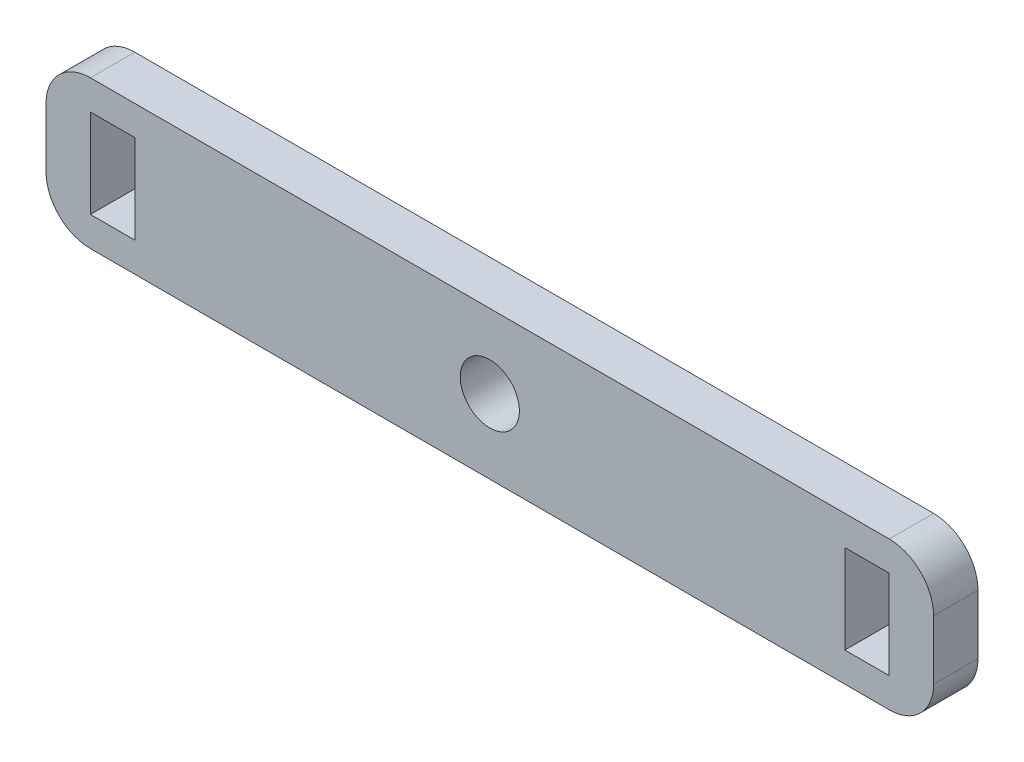
ISO-10303-21;
HEADER;
FILE_DESCRIPTION(('STEP AP214'),'2;1');
FILE_NAME('part.step','',(''),(''),'','','');
FILE_SCHEMA(('AUTOMOTIVE_DESIGN { 1 0 10303 214 1 1 1 1 }'));
ENDSEC;
DATA;
#1=APPLICATION_CONTEXT('core data for automotive mechanical design processes');
#2=APPLICATION_PROTOCOL_DEFINITION('international standard','automotive_design',2000,#1);
#3=PRODUCT_CONTEXT('',#1,'mechanical');
#4=PRODUCT('Part','Part','',(#3));
#5=PRODUCT_RELATED_PRODUCT_CATEGORY('part','',(#4));
#6=PRODUCT_DEFINITION_FORMATION('','',#4);
#7=PRODUCT_DEFINITION_CONTEXT('part definition',#1,'design');
#8=PRODUCT_DEFINITION('design','',#6,#7);
#9=PRODUCT_DEFINITION_SHAPE('','',#8);
#10=(LENGTH_UNIT() NAMED_UNIT(*) SI_UNIT(.MILLI.,.METRE.));
#11=(NAMED_UNIT(*) PLANE_ANGLE_UNIT() SI_UNIT($,.RADIAN.));
#12=(NAMED_UNIT(*) SI_UNIT($,.STERADIAN.) SOLID_ANGLE_UNIT());
#13=UNCERTAINTY_MEASURE_WITH_UNIT(LENGTH_MEASURE(1.E-05),#10,'distance_accuracy_value','');
#14=(GEOMETRIC_REPRESENTATION_CONTEXT(3) GLOBAL_UNCERTAINTY_ASSIGNED_CONTEXT((#13)) GLOBAL_UNIT_ASSIGNED_CONTEXT((#10,
#11,#12)) REPRESENTATION_CONTEXT('',''));
#15=CARTESIAN_POINT('',(0.,0.,0.));
#16=DIRECTION('',(0.,0.,1.));
#17=DIRECTION('',(1.,0.,0.));
#18=AXIS2_PLACEMENT_3D('',#15,#16,#17);
#19=CARTESIAN_POINT('',(0.,0.,3.));
#20=DIRECTION('',(0.,0.,1.));
#21=DIRECTION('',(1.,0.,0.));
#22=AXIS2_PLACEMENT_3D('',#19,#20,#21);
#23=PLANE('',#22);
#24=DIRECTION('',(0.,-1.,0.));
#25=VECTOR('',#24,1.);
#26=CARTESIAN_POINT('',(-27.,3.,3.));
#27=LINE('',#26,#25);
#28=CARTESIAN_POINT('',(-27.,3.,3.));
#29=VERTEX_POINT('',#28);
#30=CARTESIAN_POINT('',(-27.,-3.,3.));
#31=VERTEX_POINT('',#30);
#32=EDGE_CURVE('E208',#29,#31,#27,.T.);
#33=ORIENTED_EDGE('',*,*,#32,.F.);
#34=DIRECTION('',(-1.,0.,0.));
#35=VECTOR('',#34,1.);
#36=CARTESIAN_POINT('',(-27.,3.,3.));
#37=LINE('',#36,#35);
#38=CARTESIAN_POINT('',(-24.,3.,3.));
#39=VERTEX_POINT('',#38);
#40=EDGE_CURVE('E219',#39,#29,#37,.T.);
#41=ORIENTED_EDGE('',*,*,#40,.F.);
#42=DIRECTION('',(0.,1.,0.));
#43=VECTOR('',#42,1.);
#44=CARTESIAN_POINT('',(-24.,3.,3.));
#45=LINE('',#44,#43);
#46=CARTESIAN_POINT('',(-24.,-3.,3.));
#47=VERTEX_POINT('',#46);
#48=EDGE_CURVE('E238',#47,#39,#45,.T.);
#49=ORIENTED_EDGE('',*,*,#48,.F.);
#50=DIRECTION('',(1.,0.,0.));
#51=VECTOR('',#50,1.);
#52=CARTESIAN_POINT('',(-27.,-3.,3.));
#53=LINE('',#52,#51);
#54=EDGE_CURVE('E234',#31,#47,#53,.T.);
#55=ORIENTED_EDGE('',*,*,#54,.F.);
#56=EDGE_LOOP('',(#33,#41,#49,#55));
#57=FACE_BOUND('',#56,.T.);
#58=CARTESIAN_POINT('',(0.,0.,3.));
#59=DIRECTION('',(0.,0.,1.));
#60=DIRECTION('',(1.,0.,0.));
#61=AXIS2_PLACEMENT_3D('',#58,#59,#60);
#62=CIRCLE('',#61,2.);
#63=CARTESIAN_POINT('',(2.,0.,3.));
#64=VERTEX_POINT('',#63);
#65=EDGE_CURVE('E248',#64,#64,#62,.T.);
#66=ORIENTED_EDGE('',*,*,#65,.F.);
#67=EDGE_LOOP('',(#66));
#68=FACE_BOUND('',#67,.T.);
#69=DIRECTION('',(0.,-1.,0.));
#70=VECTOR('',#69,1.);
#71=CARTESIAN_POINT('',(-30.,5.,3.));
#72=LINE('',#71,#70);
#73=CARTESIAN_POINT('',(-30.,2.,3.));
#74=VERTEX_POINT('',#73);
#75=CARTESIAN_POINT('',(-30.,-2.,3.));
#76=VERTEX_POINT('',#75);
#77=EDGE_CURVE('E273',#74,#76,#72,.T.);
#78=ORIENTED_EDGE('',*,*,#77,.T.);
#79=CARTESIAN_POINT('',(-27.,-2.,3.));
#80=DIRECTION('',(0.,0.,1.));
#81=DIRECTION('',(1.,0.,0.));
#82=AXIS2_PLACEMENT_3D('',#79,#80,#81);
#83=CIRCLE('',#82,3.);
#84=CARTESIAN_POINT('',(-27.,-5.,3.));
#85=VERTEX_POINT('',#84);
#86=EDGE_CURVE('E328',#76,#85,#83,.T.);
#87=ORIENTED_EDGE('',*,*,#86,.T.);
#88=DIRECTION('',(1.,0.,0.));
#89=VECTOR('',#88,1.);
#90=CARTESIAN_POINT('',(-30.,-5.,3.));
#91=LINE('',#90,#89);
#92=CARTESIAN_POINT('',(27.,-5.,3.));
#93=VERTEX_POINT('',#92);
#94=EDGE_CURVE('E277',#85,#93,#91,.T.);
#95=ORIENTED_EDGE('',*,*,#94,.T.);
#96=CARTESIAN_POINT('',(27.,-2.,3.));
#97=DIRECTION('',(0.,0.,1.));
#98=DIRECTION('',(1.,0.,0.));
#99=AXIS2_PLACEMENT_3D('',#96,#97,#98);
#100=CIRCLE('',#99,3.);
#101=CARTESIAN_POINT('',(30.,-2.,3.));
#102=VERTEX_POINT('',#101);
#103=EDGE_CURVE('E322',#93,#102,#100,.T.);
#104=ORIENTED_EDGE('',*,*,#103,.T.);
#105=DIRECTION('',(0.,1.,0.));
#106=VECTOR('',#105,1.);
#107=CARTESIAN_POINT('',(30.,5.,3.));
#108=LINE('',#107,#106);
#109=CARTESIAN_POINT('',(30.,2.,3.));
#110=VERTEX_POINT('',#109);
#111=EDGE_CURVE('E266',#102,#110,#108,.T.);
#112=ORIENTED_EDGE('',*,*,#111,.T.);
#113=CARTESIAN_POINT('',(27.,2.,3.));
#114=DIRECTION('',(0.,0.,1.));
#115=DIRECTION('',(1.,0.,0.));
#116=AXIS2_PLACEMENT_3D('',#113,#114,#115);
#117=CIRCLE('',#116,3.);
#118=CARTESIAN_POINT('',(27.,5.,3.));
#119=VERTEX_POINT('',#118);
#120=EDGE_CURVE('E66',#110,#119,#117,.T.);
#121=ORIENTED_EDGE('',*,*,#120,.T.);
#122=DIRECTION('',(-1.,0.,0.));
#123=VECTOR('',#122,1.);
#124=CARTESIAN_POINT('',(-30.,5.,3.));
#125=LINE('',#124,#123);
#126=CARTESIAN_POINT('',(-27.,5.,3.));
#127=VERTEX_POINT('',#126);
#128=EDGE_CURVE('E269',#119,#127,#125,.T.);
#129=ORIENTED_EDGE('',*,*,#128,.T.);
#130=CARTESIAN_POINT('',(-27.,2.,3.));
#131=DIRECTION('',(0.,0.,1.));
#132=DIRECTION('',(1.,0.,0.));
#133=AXIS2_PLACEMENT_3D('',#130,#131,#132);
#134=CIRCLE('',#133,3.);
#135=EDGE_CURVE('E325',#127,#74,#134,.T.);
#136=ORIENTED_EDGE('',*,*,#135,.T.);
#137=EDGE_LOOP('',(#78,#87,#95,#104,#112,#121,#129,#136));
#138=FACE_BOUND('',#137,.T.);
#139=DIRECTION('',(1.,0.,0.));
#140=VECTOR('',#139,1.);
#141=CARTESIAN_POINT('',(27.,3.,3.));
#142=LINE('',#141,#140);
#143=CARTESIAN_POINT('',(24.,3.,3.));
#144=VERTEX_POINT('',#143);
#145=CARTESIAN_POINT('',(27.,3.,3.));
#146=VERTEX_POINT('',#145);
#147=EDGE_CURVE('E199',#144,#146,#142,.T.);
#148=ORIENTED_EDGE('',*,*,#147,.T.);
#149=DIRECTION('',(0.,-1.,0.));
#150=VECTOR('',#149,1.);
#151=CARTESIAN_POINT('',(27.,3.,3.));
#152=LINE('',#151,#150);
#153=CARTESIAN_POINT('',(27.,-3.,3.));
#154=VERTEX_POINT('',#153);
#155=EDGE_CURVE('E179',#146,#154,#152,.T.);
#156=ORIENTED_EDGE('',*,*,#155,.T.);
#157=DIRECTION('',(-1.,0.,0.));
#158=VECTOR('',#157,1.);
#159=CARTESIAN_POINT('',(27.,-3.,3.));
#160=LINE('',#159,#158);
#161=CARTESIAN_POINT('',(24.,-3.,3.));
#162=VERTEX_POINT('',#161);
#163=EDGE_CURVE('E186',#154,#162,#160,.T.);
#164=ORIENTED_EDGE('',*,*,#163,.T.);
#165=DIRECTION('',(0.,1.,0.));
#166=VECTOR('',#165,1.);
#167=CARTESIAN_POINT('',(24.,3.,3.));
#168=LINE('',#167,#166);
#169=EDGE_CURVE('E190',#162,#144,#168,.T.);
#170=ORIENTED_EDGE('',*,*,#169,.T.);
#171=EDGE_LOOP('',(#148,#156,#164,#170));
#172=FACE_BOUND('',#171,.T.);
#173=ADVANCED_FACE('F43',(#57,#68,#138,#172),#23,.T.);
#174=CARTESIAN_POINT('',(0.,0.,0.));
#175=DIRECTION('',(0.,0.,1.));
#176=DIRECTION('',(1.,0.,0.));
#177=AXIS2_PLACEMENT_3D('',#174,#175,#176);
#178=PLANE('',#177);
#179=DIRECTION('',(1.,0.,0.));
#180=VECTOR('',#179,1.);
#181=CARTESIAN_POINT('',(-30.,-5.,0.));
#182=LINE('',#181,#180);
#183=CARTESIAN_POINT('',(-27.,-5.,0.));
#184=VERTEX_POINT('',#183);
#185=CARTESIAN_POINT('',(27.,-5.,0.));
#186=VERTEX_POINT('',#185);
#187=EDGE_CURVE('E270',#184,#186,#182,.T.);
#188=ORIENTED_EDGE('',*,*,#187,.F.);
#189=CARTESIAN_POINT('',(-27.,-2.,0.));
#190=DIRECTION('',(0.,0.,1.));
#191=DIRECTION('',(1.,0.,0.));
#192=AXIS2_PLACEMENT_3D('',#189,#190,#191);
#193=CIRCLE('',#192,3.);
#194=CARTESIAN_POINT('',(-30.,-2.,0.));
#195=VERTEX_POINT('',#194);
#196=EDGE_CURVE('E310',#184,#195,#193,.F.);
#197=ORIENTED_EDGE('',*,*,#196,.T.);
#198=DIRECTION('',(0.,-1.,0.));
#199=VECTOR('',#198,1.);
#200=CARTESIAN_POINT('',(-30.,5.,0.));
#201=LINE('',#200,#199);
#202=CARTESIAN_POINT('',(-30.,2.,0.));
#203=VERTEX_POINT('',#202);
#204=EDGE_CURVE('E288',#203,#195,#201,.T.);
#205=ORIENTED_EDGE('',*,*,#204,.F.);
#206=CARTESIAN_POINT('',(-27.,2.,0.));
#207=DIRECTION('',(0.,0.,1.));
#208=DIRECTION('',(1.,0.,0.));
#209=AXIS2_PLACEMENT_3D('',#206,#207,#208);
#210=CIRCLE('',#209,3.);
#211=CARTESIAN_POINT('',(-27.,5.,0.));
#212=VERTEX_POINT('',#211);
#213=EDGE_CURVE('E307',#203,#212,#210,.F.);
#214=ORIENTED_EDGE('',*,*,#213,.T.);
#215=DIRECTION('',(-1.,0.,0.));
#216=VECTOR('',#215,1.);
#217=CARTESIAN_POINT('',(-30.,5.,0.));
#218=LINE('',#217,#216);
#219=CARTESIAN_POINT('',(27.,5.,0.));
#220=VERTEX_POINT('',#219);
#221=EDGE_CURVE('E285',#220,#212,#218,.T.);
#222=ORIENTED_EDGE('',*,*,#221,.F.);
#223=CARTESIAN_POINT('',(27.,2.,0.));
#224=DIRECTION('',(0.,0.,1.));
#225=DIRECTION('',(1.,0.,0.));
#226=AXIS2_PLACEMENT_3D('',#223,#224,#225);
#227=CIRCLE('',#226,3.);
#228=CARTESIAN_POINT('',(30.,2.,0.));
#229=VERTEX_POINT('',#228);
#230=EDGE_CURVE('E301',#220,#229,#227,.F.);
#231=ORIENTED_EDGE('',*,*,#230,.T.);
#232=DIRECTION('',(0.,1.,0.));
#233=VECTOR('',#232,1.);
#234=CARTESIAN_POINT('',(30.,5.,0.));
#235=LINE('',#234,#233);
#236=CARTESIAN_POINT('',(30.,-2.,0.));
#237=VERTEX_POINT('',#236);
#238=EDGE_CURVE('E262',#237,#229,#235,.T.);
#239=ORIENTED_EDGE('',*,*,#238,.F.);
#240=CARTESIAN_POINT('',(27.,-2.,0.));
#241=DIRECTION('',(0.,0.,1.));
#242=DIRECTION('',(1.,0.,0.));
#243=AXIS2_PLACEMENT_3D('',#240,#241,#242);
#244=CIRCLE('',#243,3.);
#245=EDGE_CURVE('E304',#237,#186,#244,.F.);
#246=ORIENTED_EDGE('',*,*,#245,.T.);
#247=EDGE_LOOP('',(#188,#197,#205,#214,#222,#231,#239,#246));
#248=FACE_BOUND('',#247,.T.);
#249=CARTESIAN_POINT('',(0.,0.,0.));
#250=DIRECTION('',(0.,0.,1.));
#251=DIRECTION('',(1.,0.,0.));
#252=AXIS2_PLACEMENT_3D('',#249,#250,#251);
#253=CIRCLE('',#252,2.);
#254=CARTESIAN_POINT('',(2.,0.,0.));
#255=VERTEX_POINT('',#254);
#256=EDGE_CURVE('E258',#255,#255,#253,.T.);
#257=ORIENTED_EDGE('',*,*,#256,.T.);
#258=EDGE_LOOP('',(#257));
#259=FACE_BOUND('',#258,.T.);
#260=DIRECTION('',(-1.,0.,0.));
#261=VECTOR('',#260,1.);
#262=CARTESIAN_POINT('',(-27.,3.,0.));
#263=LINE('',#262,#261);
#264=CARTESIAN_POINT('',(-24.,3.,0.));
#265=VERTEX_POINT('',#264);
#266=CARTESIAN_POINT('',(-27.,3.,0.));
#267=VERTEX_POINT('',#266);
#268=EDGE_CURVE('E227',#265,#267,#263,.T.);
#269=ORIENTED_EDGE('',*,*,#268,.T.);
#270=DIRECTION('',(0.,-1.,0.));
#271=VECTOR('',#270,1.);
#272=CARTESIAN_POINT('',(-27.,3.,0.));
#273=LINE('',#272,#271);
#274=CARTESIAN_POINT('',(-27.,-3.,0.));
#275=VERTEX_POINT('',#274);
#276=EDGE_CURVE('E214',#267,#275,#273,.T.);
#277=ORIENTED_EDGE('',*,*,#276,.T.);
#278=DIRECTION('',(1.,0.,0.));
#279=VECTOR('',#278,1.);
#280=CARTESIAN_POINT('',(-27.,-3.,0.));
#281=LINE('',#280,#279);
#282=CARTESIAN_POINT('',(-24.,-3.,0.));
#283=VERTEX_POINT('',#282);
#284=EDGE_CURVE('E218',#275,#283,#281,.T.);
#285=ORIENTED_EDGE('',*,*,#284,.T.);
#286=DIRECTION('',(0.,1.,0.));
#287=VECTOR('',#286,1.);
#288=CARTESIAN_POINT('',(-24.,3.,0.));
#289=LINE('',#288,#287);
#290=EDGE_CURVE('E223',#283,#265,#289,.T.);
#291=ORIENTED_EDGE('',*,*,#290,.T.);
#292=EDGE_LOOP('',(#269,#277,#285,#291));
#293=FACE_BOUND('',#292,.T.);
#294=DIRECTION('',(0.,-1.,0.));
#295=VECTOR('',#294,1.);
#296=CARTESIAN_POINT('',(27.,3.,0.));
#297=LINE('',#296,#295);
#298=CARTESIAN_POINT('',(27.,3.,0.));
#299=VERTEX_POINT('',#298);
#300=CARTESIAN_POINT('',(27.,-3.,0.));
#301=VERTEX_POINT('',#300);
#302=EDGE_CURVE('E172',#299,#301,#297,.T.);
#303=ORIENTED_EDGE('',*,*,#302,.F.);
#304=DIRECTION('',(1.,0.,0.));
#305=VECTOR('',#304,1.);
#306=CARTESIAN_POINT('',(27.,3.,0.));
#307=LINE('',#306,#305);
#308=CARTESIAN_POINT('',(24.,3.,0.));
#309=VERTEX_POINT('',#308);
#310=EDGE_CURVE('E159',#309,#299,#307,.T.);
#311=ORIENTED_EDGE('',*,*,#310,.F.);
#312=DIRECTION('',(0.,1.,0.));
#313=VECTOR('',#312,1.);
#314=CARTESIAN_POINT('',(24.,3.,0.));
#315=LINE('',#314,#313);
#316=CARTESIAN_POINT('',(24.,-3.,0.));
#317=VERTEX_POINT('',#316);
#318=EDGE_CURVE('E171',#317,#309,#315,.T.);
#319=ORIENTED_EDGE('',*,*,#318,.F.);
#320=DIRECTION('',(-1.,0.,0.));
#321=VECTOR('',#320,1.);
#322=CARTESIAN_POINT('',(27.,-3.,0.));
#323=LINE('',#322,#321);
#324=EDGE_CURVE('E181',#301,#317,#323,.T.);
#325=ORIENTED_EDGE('',*,*,#324,.F.);
#326=EDGE_LOOP('',(#303,#311,#319,#325));
#327=FACE_BOUND('',#326,.T.);
#328=ADVANCED_FACE('F184',(#248,#259,#293,#327),#178,.F.);
#329=CARTESIAN_POINT('',(30.,5.,3.));
#330=DIRECTION('',(-1.,0.,0.));
#331=DIRECTION('',(0.,0.,1.));
#332=AXIS2_PLACEMENT_3D('',#329,#330,#331);
#333=PLANE('',#332);
#334=ORIENTED_EDGE('',*,*,#111,.F.);
#335=DIRECTION('',(0.,0.,-1.));
#336=VECTOR('',#335,1.);
#337=CARTESIAN_POINT('',(30.,-2.,3.));
#338=LINE('',#337,#336);
#339=EDGE_CURVE('E11',#102,#237,#338,.T.);
#340=ORIENTED_EDGE('',*,*,#339,.T.);
#341=ORIENTED_EDGE('',*,*,#238,.T.);
#342=DIRECTION('',(0.,0.,-1.));
#343=VECTOR('',#342,1.);
#344=CARTESIAN_POINT('',(30.,2.,3.));
#345=LINE('',#344,#343);
#346=EDGE_CURVE('E52',#229,#110,#345,.F.);
#347=ORIENTED_EDGE('',*,*,#346,.T.);
#348=EDGE_LOOP('',(#334,#340,#341,#347));
#349=FACE_BOUND('',#348,.T.);
#350=ADVANCED_FACE('F340',(#349),#333,.F.);
#351=CARTESIAN_POINT('',(-30.,5.,3.));
#352=DIRECTION('',(0.,-1.,0.));
#353=DIRECTION('',(0.,0.,-1.));
#354=AXIS2_PLACEMENT_3D('',#351,#352,#353);
#355=PLANE('',#354);
#356=ORIENTED_EDGE('',*,*,#221,.T.);
#357=DIRECTION('',(0.,0.,-1.));
#358=VECTOR('',#357,1.);
#359=CARTESIAN_POINT('',(-27.,5.,3.));
#360=LINE('',#359,#358);
#361=EDGE_CURVE('E59',#212,#127,#360,.F.);
#362=ORIENTED_EDGE('',*,*,#361,.T.);
#363=ORIENTED_EDGE('',*,*,#128,.F.);
#364=DIRECTION('',(0.,0.,-1.));
#365=VECTOR('',#364,1.);
#366=CARTESIAN_POINT('',(27.,5.,3.));
#367=LINE('',#366,#365);
#368=EDGE_CURVE('E331',#119,#220,#367,.T.);
#369=ORIENTED_EDGE('',*,*,#368,.T.);
#370=EDGE_LOOP('',(#356,#362,#363,#369));
#371=FACE_BOUND('',#370,.T.);
#372=ADVANCED_FACE('F348',(#371),#355,.F.);
#373=CARTESIAN_POINT('',(-30.,5.,3.));
#374=DIRECTION('',(1.,0.,0.));
#375=DIRECTION('',(0.,0.,-1.));
#376=AXIS2_PLACEMENT_3D('',#373,#374,#375);
#377=PLANE('',#376);
#378=ORIENTED_EDGE('',*,*,#204,.T.);
#379=DIRECTION('',(0.,0.,-1.));
#380=VECTOR('',#379,1.);
#381=CARTESIAN_POINT('',(-30.,-2.,3.));
#382=LINE('',#381,#380);
#383=EDGE_CURVE('E317',#195,#76,#382,.F.);
#384=ORIENTED_EDGE('',*,*,#383,.T.);
#385=ORIENTED_EDGE('',*,*,#77,.F.);
#386=DIRECTION('',(0.,0.,-1.));
#387=VECTOR('',#386,1.);
#388=CARTESIAN_POINT('',(-30.,2.,3.));
#389=LINE('',#388,#387);
#390=EDGE_CURVE('E313',#74,#203,#389,.T.);
#391=ORIENTED_EDGE('',*,*,#390,.T.);
#392=EDGE_LOOP('',(#378,#384,#385,#391));
#393=FACE_BOUND('',#392,.T.);
#394=ADVANCED_FACE('F359',(#393),#377,.F.);
#395=CARTESIAN_POINT('',(-30.,-5.,3.));
#396=DIRECTION('',(0.,1.,0.));
#397=DIRECTION('',(0.,0.,1.));
#398=AXIS2_PLACEMENT_3D('',#395,#396,#397);
#399=PLANE('',#398);
#400=ORIENTED_EDGE('',*,*,#94,.F.);
#401=DIRECTION('',(0.,0.,-1.));
#402=VECTOR('',#401,1.);
#403=CARTESIAN_POINT('',(-27.,-5.,3.));
#404=LINE('',#403,#402);
#405=EDGE_CURVE('E297',#85,#184,#404,.T.);
#406=ORIENTED_EDGE('',*,*,#405,.T.);
#407=ORIENTED_EDGE('',*,*,#187,.T.);
#408=DIRECTION('',(0.,0.,-1.));
#409=VECTOR('',#408,1.);
#410=CARTESIAN_POINT('',(27.,-5.,3.));
#411=LINE('',#410,#409);
#412=EDGE_CURVE('E281',#186,#93,#411,.F.);
#413=ORIENTED_EDGE('',*,*,#412,.T.);
#414=EDGE_LOOP('',(#400,#406,#407,#413));
#415=FACE_BOUND('',#414,.T.);
#416=ADVANCED_FACE('F367',(#415),#399,.F.);
#417=CARTESIAN_POINT('',(0.,0.,0.));
#418=DIRECTION('',(0.,0.,1.));
#419=DIRECTION('',(1.,0.,0.));
#420=AXIS2_PLACEMENT_3D('',#417,#418,#419);
#421=CYLINDRICAL_SURFACE('',#420,2.);
#422=ORIENTED_EDGE('',*,*,#256,.F.);
#423=EDGE_LOOP('',(#422));
#424=FACE_BOUND('',#423,.T.);
#425=ORIENTED_EDGE('',*,*,#65,.T.);
#426=EDGE_LOOP('',(#425));
#427=FACE_BOUND('',#426,.T.);
#428=ADVANCED_FACE('F387',(#424,#427),#421,.F.);
#429=CARTESIAN_POINT('',(-27.,3.,0.));
#430=DIRECTION('',(-1.,0.,0.));
#431=DIRECTION('',(0.,0.,1.));
#432=AXIS2_PLACEMENT_3D('',#429,#430,#431);
#433=PLANE('',#432);
#434=ORIENTED_EDGE('',*,*,#32,.T.);
#435=DIRECTION('',(0.,0.,1.));
#436=VECTOR('',#435,1.);
#437=CARTESIAN_POINT('',(-27.,-3.,0.));
#438=LINE('',#437,#436);
#439=EDGE_CURVE('E231',#275,#31,#438,.T.);
#440=ORIENTED_EDGE('',*,*,#439,.F.);
#441=ORIENTED_EDGE('',*,*,#276,.F.);
#442=DIRECTION('',(0.,0.,1.));
#443=VECTOR('',#442,1.);
#444=CARTESIAN_POINT('',(-27.,3.,0.));
#445=LINE('',#444,#443);
#446=EDGE_CURVE('E245',#267,#29,#445,.T.);
#447=ORIENTED_EDGE('',*,*,#446,.T.);
#448=EDGE_LOOP('',(#434,#440,#441,#447));
#449=FACE_BOUND('',#448,.T.);
#450=ADVANCED_FACE('F419',(#449),#433,.F.);
#451=CARTESIAN_POINT('',(-27.,3.,0.));
#452=DIRECTION('',(0.,1.,0.));
#453=DIRECTION('',(0.,0.,1.));
#454=AXIS2_PLACEMENT_3D('',#451,#452,#453);
#455=PLANE('',#454);
#456=ORIENTED_EDGE('',*,*,#40,.T.);
#457=ORIENTED_EDGE('',*,*,#446,.F.);
#458=ORIENTED_EDGE('',*,*,#268,.F.);
#459=DIRECTION('',(0.,0.,1.));
#460=VECTOR('',#459,1.);
#461=CARTESIAN_POINT('',(-24.,3.,0.));
#462=LINE('',#461,#460);
#463=EDGE_CURVE('E249',#265,#39,#462,.T.);
#464=ORIENTED_EDGE('',*,*,#463,.T.);
#465=EDGE_LOOP('',(#456,#457,#458,#464));
#466=FACE_BOUND('',#465,.T.);
#467=ADVANCED_FACE('F415',(#466),#455,.F.);
#468=CARTESIAN_POINT('',(-24.,3.,0.));
#469=DIRECTION('',(1.,0.,0.));
#470=DIRECTION('',(0.,0.,-1.));
#471=AXIS2_PLACEMENT_3D('',#468,#469,#470);
#472=PLANE('',#471);
#473=ORIENTED_EDGE('',*,*,#48,.T.);
#474=ORIENTED_EDGE('',*,*,#463,.F.);
#475=ORIENTED_EDGE('',*,*,#290,.F.);
#476=DIRECTION('',(0.,0.,1.));
#477=VECTOR('',#476,1.);
#478=CARTESIAN_POINT('',(-24.,-3.,0.));
#479=LINE('',#478,#477);
#480=EDGE_CURVE('E252',#283,#47,#479,.T.);
#481=ORIENTED_EDGE('',*,*,#480,.T.);
#482=EDGE_LOOP('',(#473,#474,#475,#481));
#483=FACE_BOUND('',#482,.T.);
#484=ADVANCED_FACE('F418',(#483),#472,.F.);
#485=CARTESIAN_POINT('',(-27.,-3.,0.));
#486=DIRECTION('',(0.,-1.,0.));
#487=DIRECTION('',(0.,0.,-1.));
#488=AXIS2_PLACEMENT_3D('',#485,#486,#487);
#489=PLANE('',#488);
#490=ORIENTED_EDGE('',*,*,#54,.T.);
#491=ORIENTED_EDGE('',*,*,#480,.F.);
#492=ORIENTED_EDGE('',*,*,#284,.F.);
#493=ORIENTED_EDGE('',*,*,#439,.T.);
#494=EDGE_LOOP('',(#490,#491,#492,#493));
#495=FACE_BOUND('',#494,.T.);
#496=ADVANCED_FACE('F414',(#495),#489,.F.);
#497=CARTESIAN_POINT('',(27.,3.,0.));
#498=DIRECTION('',(-1.,0.,0.));
#499=DIRECTION('',(0.,0.,1.));
#500=AXIS2_PLACEMENT_3D('',#497,#498,#499);
#501=PLANE('',#500);
#502=ORIENTED_EDGE('',*,*,#155,.F.);
#503=DIRECTION('',(0.,0.,1.));
#504=VECTOR('',#503,1.);
#505=CARTESIAN_POINT('',(27.,3.,0.));
#506=LINE('',#505,#504);
#507=EDGE_CURVE('E163',#299,#146,#506,.T.);
#508=ORIENTED_EDGE('',*,*,#507,.F.);
#509=ORIENTED_EDGE('',*,*,#302,.T.);
#510=DIRECTION('',(0.,0.,1.));
#511=VECTOR('',#510,1.);
#512=CARTESIAN_POINT('',(27.,-3.,0.));
#513=LINE('',#512,#511);
#514=EDGE_CURVE('E205',#301,#154,#513,.T.);
#515=ORIENTED_EDGE('',*,*,#514,.T.);
#516=EDGE_LOOP('',(#502,#508,#509,#515));
#517=FACE_BOUND('',#516,.T.);
#518=ADVANCED_FACE('F175',(#517),#501,.T.);
#519=CARTESIAN_POINT('',(27.,-3.,0.));
#520=DIRECTION('',(0.,1.,0.));
#521=DIRECTION('',(0.,0.,1.));
#522=AXIS2_PLACEMENT_3D('',#519,#520,#521);
#523=PLANE('',#522);
#524=ORIENTED_EDGE('',*,*,#163,.F.);
#525=ORIENTED_EDGE('',*,*,#514,.F.);
#526=ORIENTED_EDGE('',*,*,#324,.T.);
#527=DIRECTION('',(0.,0.,1.));
#528=VECTOR('',#527,1.);
#529=CARTESIAN_POINT('',(24.,-3.,0.));
#530=LINE('',#529,#528);
#531=EDGE_CURVE('E209',#317,#162,#530,.T.);
#532=ORIENTED_EDGE('',*,*,#531,.T.);
#533=EDGE_LOOP('',(#524,#525,#526,#532));
#534=FACE_BOUND('',#533,.T.);
#535=ADVANCED_FACE('F407',(#534),#523,.T.);
#536=CARTESIAN_POINT('',(24.,3.,0.));
#537=DIRECTION('',(1.,0.,0.));
#538=DIRECTION('',(0.,0.,-1.));
#539=AXIS2_PLACEMENT_3D('',#536,#537,#538);
#540=PLANE('',#539);
#541=ORIENTED_EDGE('',*,*,#169,.F.);
#542=ORIENTED_EDGE('',*,*,#531,.F.);
#543=ORIENTED_EDGE('',*,*,#318,.T.);
#544=DIRECTION('',(0.,0.,1.));
#545=VECTOR('',#544,1.);
#546=CARTESIAN_POINT('',(24.,3.,0.));
#547=LINE('',#546,#545);
#548=EDGE_CURVE('E165',#309,#144,#547,.T.);
#549=ORIENTED_EDGE('',*,*,#548,.T.);
#550=EDGE_LOOP('',(#541,#542,#543,#549));
#551=FACE_BOUND('',#550,.T.);
#552=ADVANCED_FACE('F402',(#551),#540,.T.);
#553=CARTESIAN_POINT('',(27.,3.,0.));
#554=DIRECTION('',(0.,-1.,0.));
#555=DIRECTION('',(0.,0.,-1.));
#556=AXIS2_PLACEMENT_3D('',#553,#554,#555);
#557=PLANE('',#556);
#558=ORIENTED_EDGE('',*,*,#147,.F.);
#559=ORIENTED_EDGE('',*,*,#548,.F.);
#560=ORIENTED_EDGE('',*,*,#310,.T.);
#561=ORIENTED_EDGE('',*,*,#507,.T.);
#562=EDGE_LOOP('',(#558,#559,#560,#561));
#563=FACE_BOUND('',#562,.T.);
#564=ADVANCED_FACE('F162',(#563),#557,.T.);
#565=CARTESIAN_POINT('',(-27.,-2.,3.));
#566=DIRECTION('',(0.,0.,-1.));
#567=DIRECTION('',(-1.,0.,0.));
#568=AXIS2_PLACEMENT_3D('',#565,#566,#567);
#569=CYLINDRICAL_SURFACE('',#568,3.);
#570=ORIENTED_EDGE('',*,*,#86,.F.);
#571=ORIENTED_EDGE('',*,*,#383,.F.);
#572=ORIENTED_EDGE('',*,*,#196,.F.);
#573=ORIENTED_EDGE('',*,*,#405,.F.);
#574=EDGE_LOOP('',(#570,#571,#572,#573));
#575=FACE_BOUND('',#574,.T.);
#576=ADVANCED_FACE('F365',(#575),#569,.T.);
#577=CARTESIAN_POINT('',(-27.,2.,3.));
#578=DIRECTION('',(0.,0.,-1.));
#579=DIRECTION('',(-1.,0.,0.));
#580=AXIS2_PLACEMENT_3D('',#577,#578,#579);
#581=CYLINDRICAL_SURFACE('',#580,3.);
#582=ORIENTED_EDGE('',*,*,#135,.F.);
#583=ORIENTED_EDGE('',*,*,#361,.F.);
#584=ORIENTED_EDGE('',*,*,#213,.F.);
#585=ORIENTED_EDGE('',*,*,#390,.F.);
#586=EDGE_LOOP('',(#582,#583,#584,#585));
#587=FACE_BOUND('',#586,.T.);
#588=ADVANCED_FACE('F356',(#587),#581,.T.);
#589=CARTESIAN_POINT('',(27.,-2.,3.));
#590=DIRECTION('',(0.,0.,-1.));
#591=DIRECTION('',(-1.,0.,0.));
#592=AXIS2_PLACEMENT_3D('',#589,#590,#591);
#593=CYLINDRICAL_SURFACE('',#592,3.);
#594=ORIENTED_EDGE('',*,*,#103,.F.);
#595=ORIENTED_EDGE('',*,*,#412,.F.);
#596=ORIENTED_EDGE('',*,*,#245,.F.);
#597=ORIENTED_EDGE('',*,*,#339,.F.);
#598=EDGE_LOOP('',(#594,#595,#596,#597));
#599=FACE_BOUND('',#598,.T.);
#600=ADVANCED_FACE('F370',(#599),#593,.T.);
#601=CARTESIAN_POINT('',(27.,2.,3.));
#602=DIRECTION('',(0.,0.,-1.));
#603=DIRECTION('',(-1.,0.,0.));
#604=AXIS2_PLACEMENT_3D('',#601,#602,#603);
#605=CYLINDRICAL_SURFACE('',#604,3.);
#606=ORIENTED_EDGE('',*,*,#120,.F.);
#607=ORIENTED_EDGE('',*,*,#346,.F.);
#608=ORIENTED_EDGE('',*,*,#230,.F.);
#609=ORIENTED_EDGE('',*,*,#368,.F.);
#610=EDGE_LOOP('',(#606,#607,#608,#609));
#611=FACE_BOUND('',#610,.T.);
#612=ADVANCED_FACE('F45',(#611),#605,.T.);
#613=CLOSED_SHELL('',(#173,#328,#350,#372,#394,#416,#428,#450,#467,#484,#496,#518,#535,#552,
#564,#576,#588,#600,#612));
#614=MANIFOLD_SOLID_BREP('B2',#613);
#615=ADVANCED_BREP_SHAPE_REPRESENTATION('',(#18,#614),#14);
#616=SHAPE_DEFINITION_REPRESENTATION(#9,#615);
ENDSEC;
END-ISO-10303-21;
